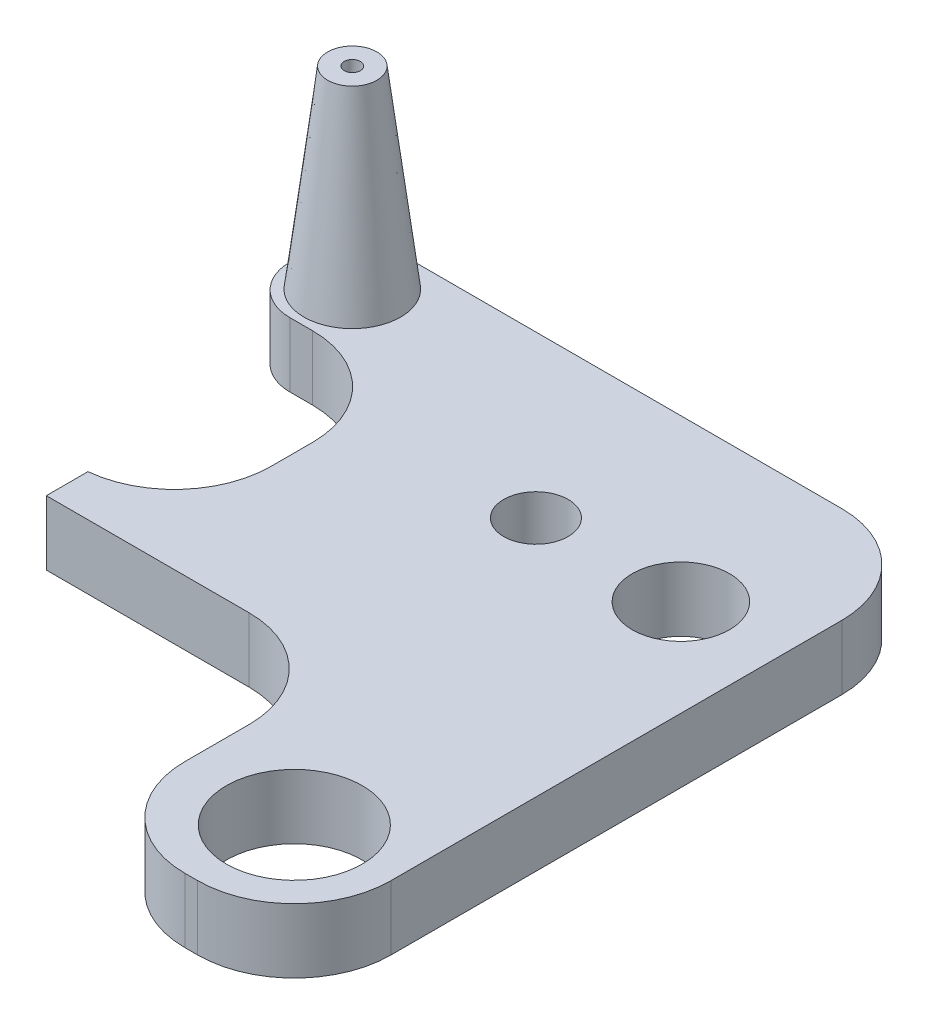
ISO-10303-21;
HEADER;
FILE_DESCRIPTION(('STEP AP214'),'2;1');
FILE_NAME('part.step','',(''),(''),'','','');
FILE_SCHEMA(('AUTOMOTIVE_DESIGN { 1 0 10303 214 1 1 1 1 }'));
ENDSEC;
DATA;
#1=APPLICATION_CONTEXT('core data for automotive mechanical design processes');
#2=APPLICATION_PROTOCOL_DEFINITION('international standard','automotive_design',2000,#1);
#3=PRODUCT_CONTEXT('',#1,'mechanical');
#4=PRODUCT('Part','Part','',(#3));
#5=PRODUCT_RELATED_PRODUCT_CATEGORY('part','',(#4));
#6=PRODUCT_DEFINITION_FORMATION('','',#4);
#7=PRODUCT_DEFINITION_CONTEXT('part definition',#1,'design');
#8=PRODUCT_DEFINITION('design','',#6,#7);
#9=PRODUCT_DEFINITION_SHAPE('','',#8);
#10=(LENGTH_UNIT() NAMED_UNIT(*) SI_UNIT(.MILLI.,.METRE.));
#11=(NAMED_UNIT(*) PLANE_ANGLE_UNIT() SI_UNIT($,.RADIAN.));
#12=(NAMED_UNIT(*) SI_UNIT($,.STERADIAN.) SOLID_ANGLE_UNIT());
#13=UNCERTAINTY_MEASURE_WITH_UNIT(LENGTH_MEASURE(1.E-05),#10,'distance_accuracy_value','');
#14=(GEOMETRIC_REPRESENTATION_CONTEXT(3) GLOBAL_UNCERTAINTY_ASSIGNED_CONTEXT((#13)) GLOBAL_UNIT_ASSIGNED_CONTEXT((#10,
#11,#12)) REPRESENTATION_CONTEXT('',''));
#15=CARTESIAN_POINT('',(0.,0.,0.));
#16=DIRECTION('',(0.,0.,1.));
#17=DIRECTION('',(1.,0.,0.));
#18=AXIS2_PLACEMENT_3D('',#15,#16,#17);
#19=CARTESIAN_POINT('',(0.,10.,0.));
#20=DIRECTION('',(0.,1.,0.));
#21=DIRECTION('',(0.,0.,1.));
#22=AXIS2_PLACEMENT_3D('',#19,#20,#21);
#23=PLANE('',#22);
#24=CARTESIAN_POINT('',(6.49587866097662,10.,-16.5));
#25=DIRECTION('',(0.,1.,0.));
#26=DIRECTION('',(0.,0.,1.));
#27=AXIS2_PLACEMENT_3D('',#24,#25,#26);
#28=CIRCLE('',#27,7.5);
#29=CARTESIAN_POINT('',(6.49587866097662,10.,-8.99999999999998));
#30=VERTEX_POINT('',#29);
#31=EDGE_CURVE('E610',#30,#30,#28,.T.);
#32=ORIENTED_EDGE('',*,*,#31,.F.);
#33=EDGE_LOOP('',(#32));
#34=FACE_BOUND('',#33,.T.);
#35=CARTESIAN_POINT('',(73.9958786609766,10.,60.));
#36=DIRECTION('',(0.,1.,0.));
#37=DIRECTION('',(0.,0.,1.));
#38=AXIS2_PLACEMENT_3D('',#35,#36,#37);
#39=CIRCLE('',#38,10.55);
#40=CARTESIAN_POINT('',(73.9958786609766,10.,70.55));
#41=VERTEX_POINT('',#40);
#42=EDGE_CURVE('E634',#41,#41,#39,.T.);
#43=ORIENTED_EDGE('',*,*,#42,.F.);
#44=EDGE_LOOP('',(#43));
#45=FACE_BOUND('',#44,.T.);
#46=DIRECTION('',(0.,0.,1.));
#47=VECTOR('',#46,1.);
#48=CARTESIAN_POINT('',(-2.00412133902338,10.,-25.));
#49=LINE('',#48,#47);
#50=CARTESIAN_POINT('',(-2.00412133902338,10.,-17.5));
#51=VERTEX_POINT('',#50);
#52=CARTESIAN_POINT('',(-2.00412133902338,10.,-15.3404728062675));
#53=VERTEX_POINT('',#52);
#54=EDGE_CURVE('E252',#51,#53,#49,.T.);
#55=ORIENTED_EDGE('',*,*,#54,.T.);
#56=CARTESIAN_POINT('',(5.49587866097662,10.,-15.3404728062675));
#57=DIRECTION('',(0.,1.,0.));
#58=DIRECTION('',(0.,0.,1.));
#59=AXIS2_PLACEMENT_3D('',#56,#57,#58);
#60=CIRCLE('',#59,7.5);
#61=CARTESIAN_POINT('',(5.49587866097662,10.,-7.84047280626752));
#62=VERTEX_POINT('',#61);
#63=EDGE_CURVE('E44',#53,#62,#60,.T.);
#64=ORIENTED_EDGE('',*,*,#63,.T.);
#65=DIRECTION('',(1.,0.,0.));
#66=VECTOR('',#65,1.);
#67=CARTESIAN_POINT('',(23.9958786609766,10.,-7.84047280626753));
#68=LINE('',#67,#66);
#69=CARTESIAN_POINT('',(8.99587866097663,10.,-7.84047280626752));
#70=VERTEX_POINT('',#69);
#71=EDGE_CURVE('E251',#62,#70,#68,.T.);
#72=ORIENTED_EDGE('',*,*,#71,.T.);
#73=CARTESIAN_POINT('',(8.99587866097663,10.,7.15952719373248));
#74=DIRECTION('',(0.,1.,0.));
#75=DIRECTION('',(0.,0.,1.));
#76=AXIS2_PLACEMENT_3D('',#73,#74,#75);
#77=CIRCLE('',#76,15.);
#78=CARTESIAN_POINT('',(23.9958786609766,10.,7.15952719373247));
#79=VERTEX_POINT('',#78);
#80=EDGE_CURVE('E231',#70,#79,#77,.F.);
#81=ORIENTED_EDGE('',*,*,#80,.T.);
#82=DIRECTION('',(0.,0.,1.));
#83=VECTOR('',#82,1.);
#84=CARTESIAN_POINT('',(23.9958786609766,10.,0.));
#85=LINE('',#84,#83);
#86=CARTESIAN_POINT('',(23.9958786609766,10.,13.6132267231807));
#87=VERTEX_POINT('',#86);
#88=EDGE_CURVE('E164',#79,#87,#85,.T.);
#89=ORIENTED_EDGE('',*,*,#88,.T.);
#90=CARTESIAN_POINT('',(8.99587866097663,10.,13.6132267231807));
#91=DIRECTION('',(0.,1.,0.));
#92=DIRECTION('',(0.,0.,1.));
#93=AXIS2_PLACEMENT_3D('',#90,#91,#92);
#94=CIRCLE('',#93,15.);
#95=CARTESIAN_POINT('',(10.4958786609766,10.,28.53803827978));
#96=VERTEX_POINT('',#95);
#97=EDGE_CURVE('E157',#87,#96,#94,.F.);
#98=ORIENTED_EDGE('',*,*,#97,.T.);
#99=DIRECTION('',(0.,0.,1.));
#100=VECTOR('',#99,1.);
#101=CARTESIAN_POINT('',(10.4958786609766,10.,28.53803827978));
#102=LINE('',#101,#100);
#103=CARTESIAN_POINT('',(10.4958786609766,10.,35.));
#104=VERTEX_POINT('',#103);
#105=EDGE_CURVE('E161',#96,#104,#102,.T.);
#106=ORIENTED_EDGE('',*,*,#105,.T.);
#107=DIRECTION('',(1.,0.,0.));
#108=VECTOR('',#107,1.);
#109=CARTESIAN_POINT('',(10.4958786609766,10.,35.));
#110=LINE('',#109,#108);
#111=CARTESIAN_POINT('',(41.9958786609766,10.,35.));
#112=VERTEX_POINT('',#111);
#113=EDGE_CURVE('E180',#104,#112,#110,.T.);
#114=ORIENTED_EDGE('',*,*,#113,.T.);
#115=CARTESIAN_POINT('',(41.9958786609766,10.,50.));
#116=DIRECTION('',(0.,1.,0.));
#117=DIRECTION('',(0.,0.,1.));
#118=AXIS2_PLACEMENT_3D('',#115,#116,#117);
#119=CIRCLE('',#118,15.);
#120=CARTESIAN_POINT('',(56.9958786609766,10.,50.));
#121=VERTEX_POINT('',#120);
#122=EDGE_CURVE('E235',#112,#121,#119,.F.);
#123=ORIENTED_EDGE('',*,*,#122,.T.);
#124=DIRECTION('',(0.,0.,1.));
#125=VECTOR('',#124,1.);
#126=CARTESIAN_POINT('',(56.9958786609766,10.,35.));
#127=LINE('',#126,#125);
#128=CARTESIAN_POINT('',(56.9958786609766,10.,60.));
#129=VERTEX_POINT('',#128);
#130=EDGE_CURVE('E305',#121,#129,#127,.T.);
#131=ORIENTED_EDGE('',*,*,#130,.T.);
#132=CARTESIAN_POINT('',(71.9958786609766,10.,60.));
#133=DIRECTION('',(0.,1.,0.));
#134=DIRECTION('',(0.,0.,1.));
#135=AXIS2_PLACEMENT_3D('',#132,#133,#134);
#136=CIRCLE('',#135,15.);
#137=CARTESIAN_POINT('',(71.9958786609766,10.,75.));
#138=VERTEX_POINT('',#137);
#139=EDGE_CURVE('E202',#129,#138,#136,.T.);
#140=ORIENTED_EDGE('',*,*,#139,.T.);
#141=DIRECTION('',(1.,0.,0.));
#142=VECTOR('',#141,1.);
#143=CARTESIAN_POINT('',(56.9958786609766,10.,75.));
#144=LINE('',#143,#142);
#145=CARTESIAN_POINT('',(73.9958786609766,10.,75.));
#146=VERTEX_POINT('',#145);
#147=EDGE_CURVE('E308',#138,#146,#144,.T.);
#148=ORIENTED_EDGE('',*,*,#147,.T.);
#149=CARTESIAN_POINT('',(73.9958786609766,10.,60.));
#150=DIRECTION('',(0.,1.,0.));
#151=DIRECTION('',(0.,0.,1.));
#152=AXIS2_PLACEMENT_3D('',#149,#150,#151);
#153=CIRCLE('',#152,15.);
#154=CARTESIAN_POINT('',(88.9958786609766,10.,60.));
#155=VERTEX_POINT('',#154);
#156=EDGE_CURVE('E204',#146,#155,#153,.T.);
#157=ORIENTED_EDGE('',*,*,#156,.T.);
#158=DIRECTION('',(0.,0.,-1.));
#159=VECTOR('',#158,1.);
#160=CARTESIAN_POINT('',(88.9958786609766,10.,75.));
#161=LINE('',#160,#159);
#162=CARTESIAN_POINT('',(88.9958786609766,10.,-9.99999999999998));
#163=VERTEX_POINT('',#162);
#164=EDGE_CURVE('E188',#155,#163,#161,.T.);
#165=ORIENTED_EDGE('',*,*,#164,.T.);
#166=CARTESIAN_POINT('',(73.9958786609766,10.,-9.99999999999998));
#167=DIRECTION('',(0.,1.,0.));
#168=DIRECTION('',(0.,0.,1.));
#169=AXIS2_PLACEMENT_3D('',#166,#167,#168);
#170=CIRCLE('',#169,15.);
#171=CARTESIAN_POINT('',(73.9958786609766,10.,-25.));
#172=VERTEX_POINT('',#171);
#173=EDGE_CURVE('E206',#163,#172,#170,.T.);
#174=ORIENTED_EDGE('',*,*,#173,.T.);
#175=DIRECTION('',(-1.,0.,0.));
#176=VECTOR('',#175,1.);
#177=CARTESIAN_POINT('',(17.5,10.,-25.));
#178=LINE('',#177,#176);
#179=CARTESIAN_POINT('',(5.49587866097662,10.,-25.));
#180=VERTEX_POINT('',#179);
#181=EDGE_CURVE('E292',#172,#180,#178,.T.);
#182=ORIENTED_EDGE('',*,*,#181,.T.);
#183=CARTESIAN_POINT('',(5.49587866097662,10.,-17.5));
#184=DIRECTION('',(0.,1.,0.));
#185=DIRECTION('',(0.,0.,1.));
#186=AXIS2_PLACEMENT_3D('',#183,#184,#185);
#187=CIRCLE('',#186,7.5);
#188=EDGE_CURVE('E248',#180,#51,#187,.T.);
#189=ORIENTED_EDGE('',*,*,#188,.T.);
#190=EDGE_LOOP('',(#55,#64,#72,#81,#89,#98,#106,#114,#123,#131,#140,#148,#157,#165,#174,#182,#189));
#191=FACE_BOUND('',#190,.T.);
#192=CARTESIAN_POINT('',(51.4958786609766,10.,0.));
#193=DIRECTION('',(0.,1.,0.));
#194=DIRECTION('',(0.,0.,1.));
#195=AXIS2_PLACEMENT_3D('',#192,#193,#194);
#196=CIRCLE('',#195,5.);
#197=CARTESIAN_POINT('',(51.4958786609766,10.,5.00000000000004));
#198=VERTEX_POINT('',#197);
#199=EDGE_CURVE('E274',#198,#198,#196,.T.);
#200=ORIENTED_EDGE('',*,*,#199,.F.);
#201=EDGE_LOOP('',(#200));
#202=FACE_BOUND('',#201,.T.);
#203=CARTESIAN_POINT('',(73.9958786609766,10.,0.));
#204=DIRECTION('',(0.,1.,0.));
#205=DIRECTION('',(0.,0.,1.));
#206=AXIS2_PLACEMENT_3D('',#203,#204,#205);
#207=CIRCLE('',#206,7.55);
#208=CARTESIAN_POINT('',(73.9958786609766,10.,7.55));
#209=VERTEX_POINT('',#208);
#210=EDGE_CURVE('E628',#209,#209,#207,.T.);
#211=ORIENTED_EDGE('',*,*,#210,.F.);
#212=EDGE_LOOP('',(#211));
#213=FACE_BOUND('',#212,.T.);
#214=ADVANCED_FACE('F36',(#34,#45,#191,#202,#213),#23,.T.);
#215=CARTESIAN_POINT('',(0.,0.,0.));
#216=DIRECTION('',(0.,1.,0.));
#217=DIRECTION('',(0.,0.,1.));
#218=AXIS2_PLACEMENT_3D('',#215,#216,#217);
#219=PLANE('',#218);
#220=DIRECTION('',(1.,0.,0.));
#221=VECTOR('',#220,1.);
#222=CARTESIAN_POINT('',(23.9958786609766,0.,-7.84047280626753));
#223=LINE('',#222,#221);
#224=CARTESIAN_POINT('',(5.49587866097662,0.,-7.84047280626752));
#225=VERTEX_POINT('',#224);
#226=CARTESIAN_POINT('',(8.99587866097663,0.,-7.84047280626752));
#227=VERTEX_POINT('',#226);
#228=EDGE_CURVE('E267',#225,#227,#223,.T.);
#229=ORIENTED_EDGE('',*,*,#228,.F.);
#230=CARTESIAN_POINT('',(5.49587866097662,0.,-15.3404728062675));
#231=DIRECTION('',(0.,1.,0.));
#232=DIRECTION('',(0.,0.,1.));
#233=AXIS2_PLACEMENT_3D('',#230,#231,#232);
#234=CIRCLE('',#233,7.5);
#235=CARTESIAN_POINT('',(-2.00412133902338,0.,-15.3404728062675));
#236=VERTEX_POINT('',#235);
#237=EDGE_CURVE('E242',#225,#236,#234,.F.);
#238=ORIENTED_EDGE('',*,*,#237,.T.);
#239=DIRECTION('',(0.,0.,1.));
#240=VECTOR('',#239,1.);
#241=CARTESIAN_POINT('',(-2.00412133902338,0.,-25.));
#242=LINE('',#241,#240);
#243=CARTESIAN_POINT('',(-2.00412133902338,0.,-17.5));
#244=VERTEX_POINT('',#243);
#245=EDGE_CURVE('E266',#244,#236,#242,.T.);
#246=ORIENTED_EDGE('',*,*,#245,.F.);
#247=CARTESIAN_POINT('',(5.49587866097662,0.,-17.5));
#248=DIRECTION('',(0.,1.,0.));
#249=DIRECTION('',(0.,0.,1.));
#250=AXIS2_PLACEMENT_3D('',#247,#248,#249);
#251=CIRCLE('',#250,7.5);
#252=CARTESIAN_POINT('',(5.49587866097662,0.,-25.));
#253=VERTEX_POINT('',#252);
#254=EDGE_CURVE('E240',#244,#253,#251,.F.);
#255=ORIENTED_EDGE('',*,*,#254,.T.);
#256=DIRECTION('',(-1.,0.,0.));
#257=VECTOR('',#256,1.);
#258=CARTESIAN_POINT('',(17.5,0.,-25.));
#259=LINE('',#258,#257);
#260=CARTESIAN_POINT('',(73.9958786609766,0.,-25.));
#261=VERTEX_POINT('',#260);
#262=EDGE_CURVE('E270',#261,#253,#259,.T.);
#263=ORIENTED_EDGE('',*,*,#262,.F.);
#264=CARTESIAN_POINT('',(73.9958786609766,0.,-9.99999999999998));
#265=DIRECTION('',(0.,1.,0.));
#266=DIRECTION('',(0.,0.,1.));
#267=AXIS2_PLACEMENT_3D('',#264,#265,#266);
#268=CIRCLE('',#267,15.);
#269=CARTESIAN_POINT('',(88.9958786609766,0.,-9.99999999999998));
#270=VERTEX_POINT('',#269);
#271=EDGE_CURVE('E195',#261,#270,#268,.F.);
#272=ORIENTED_EDGE('',*,*,#271,.T.);
#273=DIRECTION('',(0.,0.,-1.));
#274=VECTOR('',#273,1.);
#275=CARTESIAN_POINT('',(88.9958786609766,0.,25.));
#276=LINE('',#275,#274);
#277=CARTESIAN_POINT('',(88.9958786609766,0.,60.));
#278=VERTEX_POINT('',#277);
#279=EDGE_CURVE('E290',#278,#270,#276,.T.);
#280=ORIENTED_EDGE('',*,*,#279,.F.);
#281=CARTESIAN_POINT('',(73.9958786609766,0.,60.));
#282=DIRECTION('',(0.,1.,0.));
#283=DIRECTION('',(0.,0.,1.));
#284=AXIS2_PLACEMENT_3D('',#281,#282,#283);
#285=CIRCLE('',#284,15.);
#286=CARTESIAN_POINT('',(73.9958786609766,0.,75.));
#287=VERTEX_POINT('',#286);
#288=EDGE_CURVE('E193',#278,#287,#285,.F.);
#289=ORIENTED_EDGE('',*,*,#288,.T.);
#290=DIRECTION('',(1.,0.,0.));
#291=VECTOR('',#290,1.);
#292=CARTESIAN_POINT('',(56.9958786609766,0.,75.));
#293=LINE('',#292,#291);
#294=CARTESIAN_POINT('',(71.9958786609766,0.,75.));
#295=VERTEX_POINT('',#294);
#296=EDGE_CURVE('E288',#295,#287,#293,.T.);
#297=ORIENTED_EDGE('',*,*,#296,.F.);
#298=CARTESIAN_POINT('',(71.9958786609766,0.,60.));
#299=DIRECTION('',(0.,1.,0.));
#300=DIRECTION('',(0.,0.,1.));
#301=AXIS2_PLACEMENT_3D('',#298,#299,#300);
#302=CIRCLE('',#301,15.);
#303=CARTESIAN_POINT('',(56.9958786609766,0.,60.));
#304=VERTEX_POINT('',#303);
#305=EDGE_CURVE('E186',#295,#304,#302,.F.);
#306=ORIENTED_EDGE('',*,*,#305,.T.);
#307=DIRECTION('',(0.,0.,1.));
#308=VECTOR('',#307,1.);
#309=CARTESIAN_POINT('',(56.9958786609766,0.,35.));
#310=LINE('',#309,#308);
#311=CARTESIAN_POINT('',(56.9958786609766,0.,50.));
#312=VERTEX_POINT('',#311);
#313=EDGE_CURVE('E285',#312,#304,#310,.T.);
#314=ORIENTED_EDGE('',*,*,#313,.F.);
#315=CARTESIAN_POINT('',(41.9958786609766,0.,50.));
#316=DIRECTION('',(0.,1.,0.));
#317=DIRECTION('',(0.,0.,1.));
#318=AXIS2_PLACEMENT_3D('',#315,#316,#317);
#319=CIRCLE('',#318,15.);
#320=CARTESIAN_POINT('',(41.9958786609766,0.,35.));
#321=VERTEX_POINT('',#320);
#322=EDGE_CURVE('E233',#312,#321,#319,.T.);
#323=ORIENTED_EDGE('',*,*,#322,.T.);
#324=DIRECTION('',(1.,0.,0.));
#325=VECTOR('',#324,1.);
#326=CARTESIAN_POINT('',(23.9958786609766,0.,35.));
#327=LINE('',#326,#325);
#328=CARTESIAN_POINT('',(10.4958786609766,0.,35.));
#329=VERTEX_POINT('',#328);
#330=EDGE_CURVE('E282',#329,#321,#327,.T.);
#331=ORIENTED_EDGE('',*,*,#330,.F.);
#332=DIRECTION('',(0.,0.,1.));
#333=VECTOR('',#332,1.);
#334=CARTESIAN_POINT('',(10.4958786609766,0.,28.53803827978));
#335=LINE('',#334,#333);
#336=CARTESIAN_POINT('',(10.4958786609766,0.,28.53803827978));
#337=VERTEX_POINT('',#336);
#338=EDGE_CURVE('E280',#337,#329,#335,.T.);
#339=ORIENTED_EDGE('',*,*,#338,.F.);
#340=CARTESIAN_POINT('',(8.99587866097663,0.,13.6132267231807));
#341=DIRECTION('',(0.,1.,0.));
#342=DIRECTION('',(0.,0.,1.));
#343=AXIS2_PLACEMENT_3D('',#340,#341,#342);
#344=CIRCLE('',#343,15.);
#345=CARTESIAN_POINT('',(23.9958786609766,0.,13.6132267231807));
#346=VERTEX_POINT('',#345);
#347=EDGE_CURVE('E169',#337,#346,#344,.T.);
#348=ORIENTED_EDGE('',*,*,#347,.T.);
#349=DIRECTION('',(0.,0.,1.));
#350=VECTOR('',#349,1.);
#351=CARTESIAN_POINT('',(23.9958786609766,0.,0.));
#352=LINE('',#351,#350);
#353=CARTESIAN_POINT('',(23.9958786609766,0.,7.15952719373247));
#354=VERTEX_POINT('',#353);
#355=EDGE_CURVE('E272',#354,#346,#352,.T.);
#356=ORIENTED_EDGE('',*,*,#355,.F.);
#357=CARTESIAN_POINT('',(8.99587866097663,0.,7.15952719373248));
#358=DIRECTION('',(0.,1.,0.));
#359=DIRECTION('',(0.,0.,1.));
#360=AXIS2_PLACEMENT_3D('',#357,#358,#359);
#361=CIRCLE('',#360,15.);
#362=EDGE_CURVE('E168',#354,#227,#361,.T.);
#363=ORIENTED_EDGE('',*,*,#362,.T.);
#364=EDGE_LOOP('',(#229,#238,#246,#255,#263,#272,#280,#289,#297,#306,#314,#323,#331,#339,#348,
#356,#363));
#365=FACE_BOUND('',#364,.T.);
#366=CARTESIAN_POINT('',(51.4958786609766,0.,0.));
#367=DIRECTION('',(0.,1.,0.));
#368=DIRECTION('',(0.,0.,1.));
#369=AXIS2_PLACEMENT_3D('',#366,#367,#368);
#370=CIRCLE('',#369,5.);
#371=CARTESIAN_POINT('',(51.4958786609766,0.,5.00000000000004));
#372=VERTEX_POINT('',#371);
#373=EDGE_CURVE('E300',#372,#372,#370,.T.);
#374=ORIENTED_EDGE('',*,*,#373,.T.);
#375=EDGE_LOOP('',(#374));
#376=FACE_BOUND('',#375,.T.);
#377=CARTESIAN_POINT('',(73.9958786609766,0.,60.));
#378=DIRECTION('',(0.,1.,0.));
#379=DIRECTION('',(0.,0.,1.));
#380=AXIS2_PLACEMENT_3D('',#377,#378,#379);
#381=CIRCLE('',#380,10.55);
#382=CARTESIAN_POINT('',(73.9958786609766,0.,70.55));
#383=VERTEX_POINT('',#382);
#384=EDGE_CURVE('E631',#383,#383,#381,.T.);
#385=ORIENTED_EDGE('',*,*,#384,.T.);
#386=EDGE_LOOP('',(#385));
#387=FACE_BOUND('',#386,.T.);
#388=CARTESIAN_POINT('',(73.9958786609766,0.,0.));
#389=DIRECTION('',(0.,1.,0.));
#390=DIRECTION('',(0.,0.,1.));
#391=AXIS2_PLACEMENT_3D('',#388,#389,#390);
#392=CIRCLE('',#391,7.55);
#393=CARTESIAN_POINT('',(73.9958786609766,0.,7.55));
#394=VERTEX_POINT('',#393);
#395=EDGE_CURVE('E625',#394,#394,#392,.T.);
#396=ORIENTED_EDGE('',*,*,#395,.T.);
#397=EDGE_LOOP('',(#396));
#398=FACE_BOUND('',#397,.T.);
#399=ADVANCED_FACE('F264',(#365,#376,#387,#398),#219,.F.);
#400=CARTESIAN_POINT('',(17.5,10.,-25.));
#401=DIRECTION('',(0.,0.,1.));
#402=DIRECTION('',(1.,0.,0.));
#403=AXIS2_PLACEMENT_3D('',#400,#401,#402);
#404=PLANE('',#403);
#405=ORIENTED_EDGE('',*,*,#262,.T.);
#406=DIRECTION('',(0.,-1.,0.));
#407=VECTOR('',#406,1.);
#408=CARTESIAN_POINT('',(5.49587866097662,10.,-25.));
#409=LINE('',#408,#407);
#410=EDGE_CURVE('E11',#253,#180,#409,.F.);
#411=ORIENTED_EDGE('',*,*,#410,.T.);
#412=ORIENTED_EDGE('',*,*,#181,.F.);
#413=DIRECTION('',(0.,-1.,0.));
#414=VECTOR('',#413,1.);
#415=CARTESIAN_POINT('',(73.9958786609766,10.,-25.));
#416=LINE('',#415,#414);
#417=EDGE_CURVE('E183',#172,#261,#416,.T.);
#418=ORIENTED_EDGE('',*,*,#417,.T.);
#419=EDGE_LOOP('',(#405,#411,#412,#418));
#420=FACE_BOUND('',#419,.T.);
#421=ADVANCED_FACE('F319',(#420),#404,.F.);
#422=CARTESIAN_POINT('',(-2.00412133902338,10.,-25.));
#423=DIRECTION('',(1.,0.,0.));
#424=DIRECTION('',(0.,0.,-1.));
#425=AXIS2_PLACEMENT_3D('',#422,#423,#424);
#426=PLANE('',#425);
#427=ORIENTED_EDGE('',*,*,#245,.T.);
#428=DIRECTION('',(0.,-1.,0.));
#429=VECTOR('',#428,1.);
#430=CARTESIAN_POINT('',(-2.00412133902338,10.,-15.3404728062675));
#431=LINE('',#430,#429);
#432=EDGE_CURVE('E57',#236,#53,#431,.F.);
#433=ORIENTED_EDGE('',*,*,#432,.T.);
#434=ORIENTED_EDGE('',*,*,#54,.F.);
#435=DIRECTION('',(0.,-1.,0.));
#436=VECTOR('',#435,1.);
#437=CARTESIAN_POINT('',(-2.00412133902338,10.,-17.5));
#438=LINE('',#437,#436);
#439=EDGE_CURVE('E244',#51,#244,#438,.T.);
#440=ORIENTED_EDGE('',*,*,#439,.T.);
#441=EDGE_LOOP('',(#427,#433,#434,#440));
#442=FACE_BOUND('',#441,.T.);
#443=ADVANCED_FACE('F268',(#442),#426,.F.);
#444=CARTESIAN_POINT('',(23.9958786609766,10.,-7.84047280626753));
#445=DIRECTION('',(0.,0.,-1.));
#446=DIRECTION('',(-1.,0.,0.));
#447=AXIS2_PLACEMENT_3D('',#444,#445,#446);
#448=PLANE('',#447);
#449=ORIENTED_EDGE('',*,*,#71,.F.);
#450=DIRECTION('',(0.,-1.,0.));
#451=VECTOR('',#450,1.);
#452=CARTESIAN_POINT('',(5.49587866097662,10.,-7.84047280626752));
#453=LINE('',#452,#451);
#454=EDGE_CURVE('E237',#62,#225,#453,.T.);
#455=ORIENTED_EDGE('',*,*,#454,.T.);
#456=ORIENTED_EDGE('',*,*,#228,.T.);
#457=DIRECTION('',(0.,-1.,0.));
#458=VECTOR('',#457,1.);
#459=CARTESIAN_POINT('',(8.99587866097663,10.,-7.84047280626752));
#460=LINE('',#459,#458);
#461=EDGE_CURVE('E223',#227,#70,#460,.F.);
#462=ORIENTED_EDGE('',*,*,#461,.T.);
#463=EDGE_LOOP('',(#449,#455,#456,#462));
#464=FACE_BOUND('',#463,.T.);
#465=ADVANCED_FACE('F256',(#464),#448,.F.);
#466=CARTESIAN_POINT('',(23.9958786609766,10.,0.));
#467=DIRECTION('',(1.,0.,0.));
#468=DIRECTION('',(0.,0.,-1.));
#469=AXIS2_PLACEMENT_3D('',#466,#467,#468);
#470=PLANE('',#469);
#471=ORIENTED_EDGE('',*,*,#355,.T.);
#472=DIRECTION('',(0.,1.,0.));
#473=VECTOR('',#472,1.);
#474=CARTESIAN_POINT('',(23.9958786609766,10.,13.6132267231807));
#475=LINE('',#474,#473);
#476=EDGE_CURVE('E221',#346,#87,#475,.T.);
#477=ORIENTED_EDGE('',*,*,#476,.T.);
#478=ORIENTED_EDGE('',*,*,#88,.F.);
#479=DIRECTION('',(0.,-1.,0.));
#480=VECTOR('',#479,1.);
#481=CARTESIAN_POINT('',(23.9958786609766,0.,7.15952719373247));
#482=LINE('',#481,#480);
#483=EDGE_CURVE('E218',#79,#354,#482,.T.);
#484=ORIENTED_EDGE('',*,*,#483,.T.);
#485=EDGE_LOOP('',(#471,#477,#478,#484));
#486=FACE_BOUND('',#485,.T.);
#487=ADVANCED_FACE('F356',(#486),#470,.F.);
#488=CARTESIAN_POINT('',(10.4958786609766,10.,28.53803827978));
#489=DIRECTION('',(1.,0.,0.));
#490=DIRECTION('',(0.,0.,-1.));
#491=AXIS2_PLACEMENT_3D('',#488,#489,#490);
#492=PLANE('',#491);
#493=CARTESIAN_POINT('',(10.4958786609766,5.,31.76901913989));
#494=DIRECTION('',(-1.,0.,0.));
#495=DIRECTION('',(0.,0.,1.));
#496=AXIS2_PLACEMENT_3D('',#493,#494,#495);
#497=CIRCLE('',#496,1.25);
#498=CARTESIAN_POINT('',(10.4958786609766,5.,33.01901913989));
#499=VERTEX_POINT('',#498);
#500=EDGE_CURVE('E621',#499,#499,#497,.T.);
#501=ORIENTED_EDGE('',*,*,#500,.F.);
#502=EDGE_LOOP('',(#501));
#503=FACE_BOUND('',#502,.T.);
#504=ORIENTED_EDGE('',*,*,#338,.T.);
#505=DIRECTION('',(0.,-1.,0.));
#506=VECTOR('',#505,1.);
#507=CARTESIAN_POINT('',(10.4958786609766,10.,35.));
#508=LINE('',#507,#506);
#509=EDGE_CURVE('E178',#104,#329,#508,.T.);
#510=ORIENTED_EDGE('',*,*,#509,.F.);
#511=ORIENTED_EDGE('',*,*,#105,.F.);
#512=DIRECTION('',(0.,-1.,0.));
#513=VECTOR('',#512,1.);
#514=CARTESIAN_POINT('',(10.4958786609766,10.,28.53803827978));
#515=LINE('',#514,#513);
#516=EDGE_CURVE('E175',#96,#337,#515,.T.);
#517=ORIENTED_EDGE('',*,*,#516,.T.);
#518=EDGE_LOOP('',(#504,#510,#511,#517));
#519=FACE_BOUND('',#518,.T.);
#520=ADVANCED_FACE('F174',(#503,#519),#492,.F.);
#521=CARTESIAN_POINT('',(23.9958786609766,10.,35.));
#522=DIRECTION('',(0.,0.,-1.));
#523=DIRECTION('',(-1.,0.,0.));
#524=AXIS2_PLACEMENT_3D('',#521,#522,#523);
#525=PLANE('',#524);
#526=ORIENTED_EDGE('',*,*,#330,.T.);
#527=DIRECTION('',(0.,-1.,0.));
#528=VECTOR('',#527,1.);
#529=CARTESIAN_POINT('',(41.9958786609766,10.,35.));
#530=LINE('',#529,#528);
#531=EDGE_CURVE('E226',#321,#112,#530,.F.);
#532=ORIENTED_EDGE('',*,*,#531,.T.);
#533=ORIENTED_EDGE('',*,*,#113,.F.);
#534=ORIENTED_EDGE('',*,*,#509,.T.);
#535=EDGE_LOOP('',(#526,#532,#533,#534));
#536=FACE_BOUND('',#535,.T.);
#537=ADVANCED_FACE('F349',(#536),#525,.F.);
#538=CARTESIAN_POINT('',(56.9958786609766,10.,35.));
#539=DIRECTION('',(1.,0.,0.));
#540=DIRECTION('',(0.,0.,-1.));
#541=AXIS2_PLACEMENT_3D('',#538,#539,#540);
#542=PLANE('',#541);
#543=ORIENTED_EDGE('',*,*,#313,.T.);
#544=DIRECTION('',(0.,-1.,0.));
#545=VECTOR('',#544,1.);
#546=CARTESIAN_POINT('',(56.9958786609766,10.,60.));
#547=LINE('',#546,#545);
#548=EDGE_CURVE('E216',#304,#129,#547,.F.);
#549=ORIENTED_EDGE('',*,*,#548,.T.);
#550=ORIENTED_EDGE('',*,*,#130,.F.);
#551=DIRECTION('',(0.,-1.,0.));
#552=VECTOR('',#551,1.);
#553=CARTESIAN_POINT('',(56.9958786609766,0.,50.));
#554=LINE('',#553,#552);
#555=EDGE_CURVE('E213',#121,#312,#554,.T.);
#556=ORIENTED_EDGE('',*,*,#555,.T.);
#557=EDGE_LOOP('',(#543,#549,#550,#556));
#558=FACE_BOUND('',#557,.T.);
#559=ADVANCED_FACE('F345',(#558),#542,.F.);
#560=CARTESIAN_POINT('',(56.9958786609766,10.,75.));
#561=DIRECTION('',(0.,0.,-1.));
#562=DIRECTION('',(-1.,0.,0.));
#563=AXIS2_PLACEMENT_3D('',#560,#561,#562);
#564=PLANE('',#563);
#565=ORIENTED_EDGE('',*,*,#296,.T.);
#566=DIRECTION('',(0.,-1.,0.));
#567=VECTOR('',#566,1.);
#568=CARTESIAN_POINT('',(73.9958786609766,10.,75.));
#569=LINE('',#568,#567);
#570=EDGE_CURVE('E211',#287,#146,#569,.F.);
#571=ORIENTED_EDGE('',*,*,#570,.T.);
#572=ORIENTED_EDGE('',*,*,#147,.F.);
#573=DIRECTION('',(0.,-1.,0.));
#574=VECTOR('',#573,1.);
#575=CARTESIAN_POINT('',(71.9958786609766,10.,75.));
#576=LINE('',#575,#574);
#577=EDGE_CURVE('E208',#138,#295,#576,.T.);
#578=ORIENTED_EDGE('',*,*,#577,.T.);
#579=EDGE_LOOP('',(#565,#571,#572,#578));
#580=FACE_BOUND('',#579,.T.);
#581=ADVANCED_FACE('F342',(#580),#564,.F.);
#582=CARTESIAN_POINT('',(88.9958786609766,10.,25.));
#583=DIRECTION('',(-1.,0.,0.));
#584=DIRECTION('',(0.,0.,1.));
#585=AXIS2_PLACEMENT_3D('',#582,#583,#584);
#586=PLANE('',#585);
#587=ORIENTED_EDGE('',*,*,#279,.T.);
#588=DIRECTION('',(0.,-1.,0.));
#589=VECTOR('',#588,1.);
#590=CARTESIAN_POINT('',(88.9958786609766,10.,-9.99999999999998));
#591=LINE('',#590,#589);
#592=EDGE_CURVE('E200',#270,#163,#591,.F.);
#593=ORIENTED_EDGE('',*,*,#592,.T.);
#594=ORIENTED_EDGE('',*,*,#164,.F.);
#595=DIRECTION('',(0.,-1.,0.));
#596=VECTOR('',#595,1.);
#597=CARTESIAN_POINT('',(88.9958786609766,10.,60.));
#598=LINE('',#597,#596);
#599=EDGE_CURVE('E197',#155,#278,#598,.T.);
#600=ORIENTED_EDGE('',*,*,#599,.T.);
#601=EDGE_LOOP('',(#587,#593,#594,#600));
#602=FACE_BOUND('',#601,.T.);
#603=ADVANCED_FACE('F339',(#602),#586,.F.);
#604=CARTESIAN_POINT('',(51.4958786609766,10.,0.));
#605=DIRECTION('',(0.,-1.,0.));
#606=DIRECTION('',(0.,0.,-1.));
#607=AXIS2_PLACEMENT_3D('',#604,#605,#606);
#608=CYLINDRICAL_SURFACE('',#607,5.);
#609=ORIENTED_EDGE('',*,*,#199,.T.);
#610=EDGE_LOOP('',(#609));
#611=FACE_BOUND('',#610,.T.);
#612=ORIENTED_EDGE('',*,*,#373,.F.);
#613=EDGE_LOOP('',(#612));
#614=FACE_BOUND('',#613,.T.);
#615=ADVANCED_FACE('F336',(#611,#614),#608,.F.);
#616=CARTESIAN_POINT('',(73.9958786609766,10.,60.));
#617=DIRECTION('',(0.,-1.,0.));
#618=DIRECTION('',(0.,0.,-1.));
#619=AXIS2_PLACEMENT_3D('',#616,#617,#618);
#620=CYLINDRICAL_SURFACE('',#619,10.55);
#621=ORIENTED_EDGE('',*,*,#42,.T.);
#622=EDGE_LOOP('',(#621));
#623=FACE_BOUND('',#622,.T.);
#624=ORIENTED_EDGE('',*,*,#384,.F.);
#625=EDGE_LOOP('',(#624));
#626=FACE_BOUND('',#625,.T.);
#627=ADVANCED_FACE('F477',(#623,#626),#620,.F.);
#628=CARTESIAN_POINT('',(73.9958786609766,10.,0.));
#629=DIRECTION('',(0.,-1.,0.));
#630=DIRECTION('',(0.,0.,-1.));
#631=AXIS2_PLACEMENT_3D('',#628,#629,#630);
#632=CYLINDRICAL_SURFACE('',#631,7.55);
#633=ORIENTED_EDGE('',*,*,#210,.T.);
#634=EDGE_LOOP('',(#633));
#635=FACE_BOUND('',#634,.T.);
#636=ORIENTED_EDGE('',*,*,#395,.F.);
#637=EDGE_LOOP('',(#636));
#638=FACE_BOUND('',#637,.T.);
#639=ADVANCED_FACE('F484',(#635,#638),#632,.F.);
#640=CARTESIAN_POINT('',(20.4958786609766,5.,31.76901913989));
#641=DIRECTION('',(-1.,0.,0.));
#642=DIRECTION('',(0.,0.,1.));
#643=AXIS2_PLACEMENT_3D('',#640,#641,#642);
#644=CYLINDRICAL_SURFACE('',#643,1.25);
#645=CARTESIAN_POINT('',(20.4958786609766,5.,31.76901913989));
#646=DIRECTION('',(-1.,0.,0.));
#647=DIRECTION('',(0.,0.,1.));
#648=AXIS2_PLACEMENT_3D('',#645,#646,#647);
#649=CIRCLE('',#648,1.25);
#650=CARTESIAN_POINT('',(20.4958786609766,5.,33.01901913989));
#651=VERTEX_POINT('',#650);
#652=EDGE_CURVE('E622',#651,#651,#649,.T.);
#653=ORIENTED_EDGE('',*,*,#652,.F.);
#654=EDGE_LOOP('',(#653));
#655=FACE_BOUND('',#654,.T.);
#656=ORIENTED_EDGE('',*,*,#500,.T.);
#657=EDGE_LOOP('',(#656));
#658=FACE_BOUND('',#657,.T.);
#659=ADVANCED_FACE('F491',(#655,#658),#644,.F.);
#660=CARTESIAN_POINT('',(20.4958786609766,5.,31.76901913989));
#661=DIRECTION('',(-1.,0.,0.));
#662=DIRECTION('',(0.,0.,1.));
#663=AXIS2_PLACEMENT_3D('',#660,#661,#662);
#664=PLANE('',#663);
#665=ORIENTED_EDGE('',*,*,#652,.T.);
#666=EDGE_LOOP('',(#665));
#667=FACE_BOUND('',#666,.T.);
#668=ADVANCED_FACE('F499',(#667),#664,.T.);
#669=CARTESIAN_POINT('',(6.49587866097662,10.,-16.5));
#670=DIRECTION('',(0.,-1.,0.));
#671=DIRECTION('',(0.,0.,1.));
#672=AXIS2_PLACEMENT_3D('',#669,#670,#671);
#673=CONICAL_SURFACE('',#672,7.5,0.122173047639603);
#674=CARTESIAN_POINT('',(6.49587866097662,40.,-16.5));
#675=DIRECTION('',(0.,1.,0.));
#676=DIRECTION('',(0.,0.,1.));
#677=AXIS2_PLACEMENT_3D('',#674,#675,#676);
#678=CIRCLE('',#677,3.81646317291285);
#679=CARTESIAN_POINT('',(6.49587866097662,40.,-12.6835368270871));
#680=VERTEX_POINT('',#679);
#681=EDGE_CURVE('E614',#680,#680,#678,.T.);
#682=ORIENTED_EDGE('',*,*,#681,.F.);
#683=EDGE_LOOP('',(#682));
#684=FACE_BOUND('',#683,.T.);
#685=ORIENTED_EDGE('',*,*,#31,.T.);
#686=EDGE_LOOP('',(#685));
#687=FACE_BOUND('',#686,.T.);
#688=ADVANCED_FACE('F507',(#684,#687),#673,.T.);
#689=CARTESIAN_POINT('',(6.49587866097662,40.,-16.5));
#690=DIRECTION('',(0.,1.,0.));
#691=DIRECTION('',(0.,0.,1.));
#692=AXIS2_PLACEMENT_3D('',#689,#690,#691);
#693=PLANE('',#692);
#694=CARTESIAN_POINT('',(6.49587866097662,40.,-16.5));
#695=DIRECTION('',(0.,1.,0.));
#696=DIRECTION('',(0.,0.,1.));
#697=AXIS2_PLACEMENT_3D('',#694,#695,#696);
#698=CIRCLE('',#697,1.25);
#699=CARTESIAN_POINT('',(6.49587866097662,40.,-15.25));
#700=VERTEX_POINT('',#699);
#701=EDGE_CURVE('E611',#700,#700,#698,.T.);
#702=ORIENTED_EDGE('',*,*,#701,.F.);
#703=EDGE_LOOP('',(#702));
#704=FACE_BOUND('',#703,.T.);
#705=ORIENTED_EDGE('',*,*,#681,.T.);
#706=EDGE_LOOP('',(#705));
#707=FACE_BOUND('',#706,.T.);
#708=ADVANCED_FACE('F515',(#704,#707),#693,.T.);
#709=CARTESIAN_POINT('',(6.49587866097662,30.,-16.5));
#710=DIRECTION('',(0.,1.,0.));
#711=DIRECTION('',(0.,0.,1.));
#712=AXIS2_PLACEMENT_3D('',#709,#710,#711);
#713=CYLINDRICAL_SURFACE('',#712,1.25);
#714=CARTESIAN_POINT('',(6.49587866097662,30.,-16.5));
#715=DIRECTION('',(0.,1.,0.));
#716=DIRECTION('',(0.,0.,1.));
#717=AXIS2_PLACEMENT_3D('',#714,#715,#716);
#718=CIRCLE('',#717,1.25);
#719=CARTESIAN_POINT('',(6.49587866097662,30.,-15.25));
#720=VERTEX_POINT('',#719);
#721=EDGE_CURVE('E609',#720,#720,#718,.T.);
#722=ORIENTED_EDGE('',*,*,#721,.F.);
#723=EDGE_LOOP('',(#722));
#724=FACE_BOUND('',#723,.T.);
#725=ORIENTED_EDGE('',*,*,#701,.T.);
#726=EDGE_LOOP('',(#725));
#727=FACE_BOUND('',#726,.T.);
#728=ADVANCED_FACE('F523',(#724,#727),#713,.F.);
#729=CARTESIAN_POINT('',(6.49587866097662,30.,-16.5));
#730=DIRECTION('',(0.,1.,0.));
#731=DIRECTION('',(0.,0.,1.));
#732=AXIS2_PLACEMENT_3D('',#729,#730,#731);
#733=PLANE('',#732);
#734=ORIENTED_EDGE('',*,*,#721,.T.);
#735=EDGE_LOOP('',(#734));
#736=FACE_BOUND('',#735,.T.);
#737=ADVANCED_FACE('F370',(#736),#733,.T.);
#738=CARTESIAN_POINT('',(73.9958786609766,10.,-9.99999999999998));
#739=DIRECTION('',(0.,-1.,0.));
#740=DIRECTION('',(0.,0.,-1.));
#741=AXIS2_PLACEMENT_3D('',#738,#739,#740);
#742=CYLINDRICAL_SURFACE('',#741,15.);
#743=ORIENTED_EDGE('',*,*,#173,.F.);
#744=ORIENTED_EDGE('',*,*,#592,.F.);
#745=ORIENTED_EDGE('',*,*,#271,.F.);
#746=ORIENTED_EDGE('',*,*,#417,.F.);
#747=EDGE_LOOP('',(#743,#744,#745,#746));
#748=FACE_BOUND('',#747,.T.);
#749=ADVANCED_FACE('F317',(#748),#742,.T.);
#750=CARTESIAN_POINT('',(73.9958786609766,10.,60.));
#751=DIRECTION('',(0.,-1.,0.));
#752=DIRECTION('',(0.,0.,-1.));
#753=AXIS2_PLACEMENT_3D('',#750,#751,#752);
#754=CYLINDRICAL_SURFACE('',#753,15.);
#755=ORIENTED_EDGE('',*,*,#156,.F.);
#756=ORIENTED_EDGE('',*,*,#570,.F.);
#757=ORIENTED_EDGE('',*,*,#288,.F.);
#758=ORIENTED_EDGE('',*,*,#599,.F.);
#759=EDGE_LOOP('',(#755,#756,#757,#758));
#760=FACE_BOUND('',#759,.T.);
#761=ADVANCED_FACE('F369',(#760),#754,.T.);
#762=CARTESIAN_POINT('',(71.9958786609766,10.,60.));
#763=DIRECTION('',(0.,-1.,0.));
#764=DIRECTION('',(0.,0.,-1.));
#765=AXIS2_PLACEMENT_3D('',#762,#763,#764);
#766=CYLINDRICAL_SURFACE('',#765,15.);
#767=ORIENTED_EDGE('',*,*,#139,.F.);
#768=ORIENTED_EDGE('',*,*,#548,.F.);
#769=ORIENTED_EDGE('',*,*,#305,.F.);
#770=ORIENTED_EDGE('',*,*,#577,.F.);
#771=EDGE_LOOP('',(#767,#768,#769,#770));
#772=FACE_BOUND('',#771,.T.);
#773=ADVANCED_FACE('F373',(#772),#766,.T.);
#774=CARTESIAN_POINT('',(8.99587866097663,10.,13.6132267231807));
#775=DIRECTION('',(0.,1.,0.));
#776=DIRECTION('',(0.,0.,1.));
#777=AXIS2_PLACEMENT_3D('',#774,#775,#776);
#778=CYLINDRICAL_SURFACE('',#777,15.);
#779=ORIENTED_EDGE('',*,*,#97,.F.);
#780=ORIENTED_EDGE('',*,*,#476,.F.);
#781=ORIENTED_EDGE('',*,*,#347,.F.);
#782=ORIENTED_EDGE('',*,*,#516,.F.);
#783=EDGE_LOOP('',(#779,#780,#781,#782));
#784=FACE_BOUND('',#783,.T.);
#785=ADVANCED_FACE('F182',(#784),#778,.F.);
#786=CARTESIAN_POINT('',(8.99587866097663,10.,7.15952719373248));
#787=DIRECTION('',(0.,1.,0.));
#788=DIRECTION('',(0.,0.,1.));
#789=AXIS2_PLACEMENT_3D('',#786,#787,#788);
#790=CYLINDRICAL_SURFACE('',#789,15.);
#791=ORIENTED_EDGE('',*,*,#80,.F.);
#792=ORIENTED_EDGE('',*,*,#461,.F.);
#793=ORIENTED_EDGE('',*,*,#362,.F.);
#794=ORIENTED_EDGE('',*,*,#483,.F.);
#795=EDGE_LOOP('',(#791,#792,#793,#794));
#796=FACE_BOUND('',#795,.T.);
#797=ADVANCED_FACE('F380',(#796),#790,.F.);
#798=CARTESIAN_POINT('',(41.9958786609766,10.,50.));
#799=DIRECTION('',(0.,1.,0.));
#800=DIRECTION('',(0.,0.,1.));
#801=AXIS2_PLACEMENT_3D('',#798,#799,#800);
#802=CYLINDRICAL_SURFACE('',#801,15.);
#803=ORIENTED_EDGE('',*,*,#122,.F.);
#804=ORIENTED_EDGE('',*,*,#531,.F.);
#805=ORIENTED_EDGE('',*,*,#322,.F.);
#806=ORIENTED_EDGE('',*,*,#555,.F.);
#807=EDGE_LOOP('',(#803,#804,#805,#806));
#808=FACE_BOUND('',#807,.T.);
#809=ADVANCED_FACE('F325',(#808),#802,.F.);
#810=CARTESIAN_POINT('',(5.49587866097662,10.,-15.3404728062675));
#811=DIRECTION('',(0.,-1.,0.));
#812=DIRECTION('',(0.,0.,-1.));
#813=AXIS2_PLACEMENT_3D('',#810,#811,#812);
#814=CYLINDRICAL_SURFACE('',#813,7.5);
#815=ORIENTED_EDGE('',*,*,#63,.F.);
#816=ORIENTED_EDGE('',*,*,#432,.F.);
#817=ORIENTED_EDGE('',*,*,#237,.F.);
#818=ORIENTED_EDGE('',*,*,#454,.F.);
#819=EDGE_LOOP('',(#815,#816,#817,#818));
#820=FACE_BOUND('',#819,.T.);
#821=ADVANCED_FACE('F261',(#820),#814,.T.);
#822=CARTESIAN_POINT('',(5.49587866097662,10.,-17.5));
#823=DIRECTION('',(0.,-1.,0.));
#824=DIRECTION('',(0.,0.,-1.));
#825=AXIS2_PLACEMENT_3D('',#822,#823,#824);
#826=CYLINDRICAL_SURFACE('',#825,7.5);
#827=ORIENTED_EDGE('',*,*,#188,.F.);
#828=ORIENTED_EDGE('',*,*,#410,.F.);
#829=ORIENTED_EDGE('',*,*,#254,.F.);
#830=ORIENTED_EDGE('',*,*,#439,.F.);
#831=EDGE_LOOP('',(#827,#828,#829,#830));
#832=FACE_BOUND('',#831,.T.);
#833=ADVANCED_FACE('F38',(#832),#826,.T.);
#834=CLOSED_SHELL('',(#214,#399,#421,#443,#465,#487,#520,#537,#559,#581,#603,#615,#627,#639,
#659,#668,#688,#708,#728,#737,#749,#761,#773,#785,#797,#809,#821,#833));
#835=MANIFOLD_SOLID_BREP('B2',#834);
#836=ADVANCED_BREP_SHAPE_REPRESENTATION('',(#18,#835),#14);
#837=SHAPE_DEFINITION_REPRESENTATION(#9,#836);
ENDSEC;
END-ISO-10303-21;
